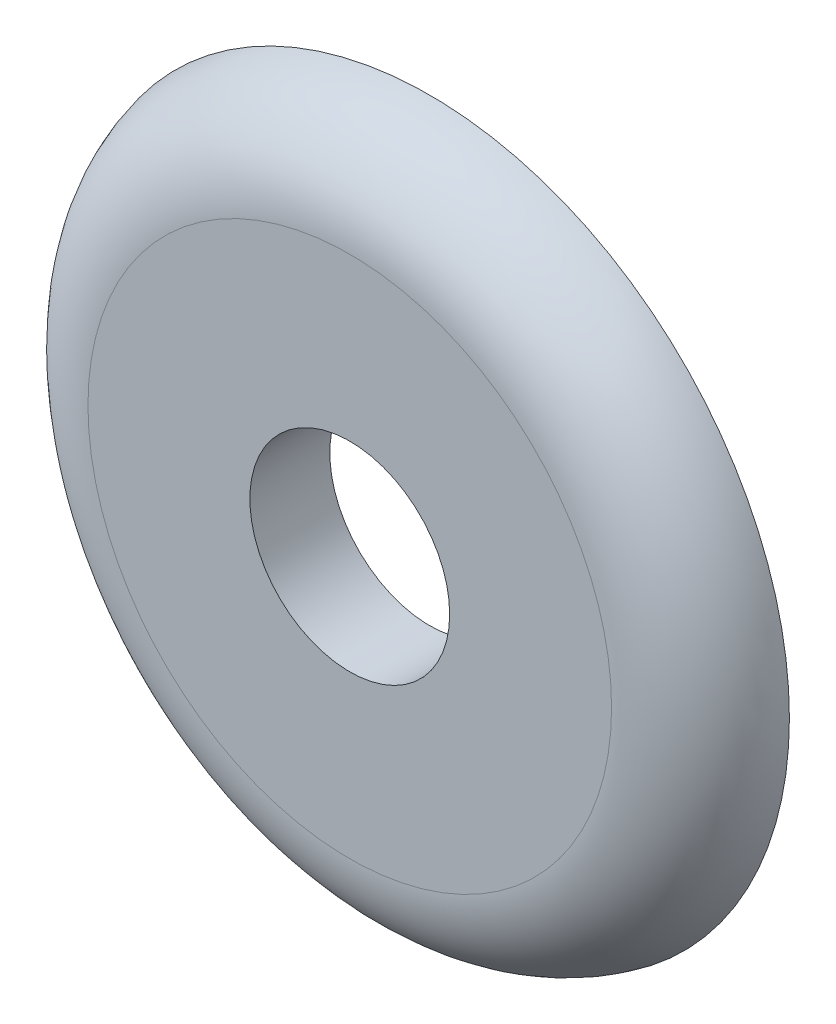
ISO-10303-21;
HEADER;
FILE_DESCRIPTION(('STEP AP214'),'2;1');
FILE_NAME('part.step','',(''),(''),'','','');
FILE_SCHEMA(('AUTOMOTIVE_DESIGN { 1 0 10303 214 1 1 1 1 }'));
ENDSEC;
DATA;
#1=APPLICATION_CONTEXT('core data for automotive mechanical design processes');
#2=APPLICATION_PROTOCOL_DEFINITION('international standard','automotive_design',2000,#1);
#3=PRODUCT_CONTEXT('',#1,'mechanical');
#4=PRODUCT('Part','Part','',(#3));
#5=PRODUCT_RELATED_PRODUCT_CATEGORY('part','',(#4));
#6=PRODUCT_DEFINITION_FORMATION('','',#4);
#7=PRODUCT_DEFINITION_CONTEXT('part definition',#1,'design');
#8=PRODUCT_DEFINITION('design','',#6,#7);
#9=PRODUCT_DEFINITION_SHAPE('','',#8);
#10=(LENGTH_UNIT() NAMED_UNIT(*) SI_UNIT(.MILLI.,.METRE.));
#11=(NAMED_UNIT(*) PLANE_ANGLE_UNIT() SI_UNIT($,.RADIAN.));
#12=(NAMED_UNIT(*) SI_UNIT($,.STERADIAN.) SOLID_ANGLE_UNIT());
#13=UNCERTAINTY_MEASURE_WITH_UNIT(LENGTH_MEASURE(1.E-05),#10,'distance_accuracy_value','');
#14=(GEOMETRIC_REPRESENTATION_CONTEXT(3) GLOBAL_UNCERTAINTY_ASSIGNED_CONTEXT((#13)) GLOBAL_UNIT_ASSIGNED_CONTEXT((#10,
#11,#12)) REPRESENTATION_CONTEXT('',''));
#15=CARTESIAN_POINT('',(0.,0.,0.));
#16=DIRECTION('',(0.,0.,1.));
#17=DIRECTION('',(1.,0.,0.));
#18=AXIS2_PLACEMENT_3D('',#15,#16,#17);
#19=CARTESIAN_POINT('',(0.,0.,-0.25));
#20=DIRECTION('',(0.,0.,1.));
#21=DIRECTION('',(1.,0.,0.));
#22=AXIS2_PLACEMENT_3D('',#19,#20,#21);
#23=TOROIDAL_SURFACE('',#22,3.27525512860841,1.25);
#24=CARTESIAN_POINT('',(0.,0.,0.));
#25=DIRECTION('',(0.,0.,-1.));
#26=DIRECTION('',(1.,0.,0.));
#27=AXIS2_PLACEMENT_3D('',#24,#25,#26);
#28=CIRCLE('',#27,4.5);
#29=CARTESIAN_POINT('',(4.5,0.,0.));
#30=VERTEX_POINT('',#29);
#31=EDGE_CURVE('E11',#30,#30,#28,.T.);
#32=ORIENTED_EDGE('',*,*,#31,.F.);
#33=EDGE_LOOP('',(#32));
#34=FACE_BOUND('',#33,.T.);
#35=CARTESIAN_POINT('',(0.,0.,1.));
#36=DIRECTION('',(0.,0.,1.));
#37=DIRECTION('',(-1.,0.,0.));
#38=AXIS2_PLACEMENT_3D('',#35,#36,#37);
#39=CIRCLE('',#38,3.27525512860841);
#40=CARTESIAN_POINT('',(-3.27525512860841,0.,1.));
#41=VERTEX_POINT('',#40);
#42=EDGE_CURVE('E19',#41,#41,#39,.T.);
#43=ORIENTED_EDGE('',*,*,#42,.F.);
#44=EDGE_LOOP('',(#43));
#45=FACE_BOUND('',#44,.T.);
#46=ADVANCED_FACE('F16',(#34,#45),#23,.T.);
#47=CARTESIAN_POINT('',(0.,0.,0.));
#48=DIRECTION('',(0.,0.,-1.));
#49=DIRECTION('',(0.,-1.,0.));
#50=AXIS2_PLACEMENT_3D('',#47,#48,#49);
#51=PLANE('',#50);
#52=ORIENTED_EDGE('',*,*,#31,.T.);
#53=EDGE_LOOP('',(#52));
#54=FACE_BOUND('',#53,.T.);
#55=CARTESIAN_POINT('',(0.,0.,0.));
#56=DIRECTION('',(0.,0.,-1.));
#57=DIRECTION('',(1.,0.,0.));
#58=AXIS2_PLACEMENT_3D('',#55,#56,#57);
#59=CIRCLE('',#58,1.25);
#60=CARTESIAN_POINT('',(1.25,0.,0.));
#61=VERTEX_POINT('',#60);
#62=EDGE_CURVE('E50',#61,#61,#59,.T.);
#63=ORIENTED_EDGE('',*,*,#62,.F.);
#64=EDGE_LOOP('',(#63));
#65=FACE_BOUND('',#64,.T.);
#66=ADVANCED_FACE('F76',(#54,#65),#51,.T.);
#67=CARTESIAN_POINT('',(0.,0.,1.));
#68=DIRECTION('',(0.,0.,-1.));
#69=DIRECTION('',(0.,-1.,0.));
#70=AXIS2_PLACEMENT_3D('',#67,#68,#69);
#71=PLANE('',#70);
#72=CARTESIAN_POINT('',(0.,0.,1.));
#73=DIRECTION('',(0.,0.,-1.));
#74=DIRECTION('',(1.,0.,0.));
#75=AXIS2_PLACEMENT_3D('',#72,#73,#74);
#76=CIRCLE('',#75,1.25);
#77=CARTESIAN_POINT('',(1.25,0.,1.));
#78=VERTEX_POINT('',#77);
#79=EDGE_CURVE('E44',#78,#78,#76,.T.);
#80=ORIENTED_EDGE('',*,*,#79,.T.);
#81=EDGE_LOOP('',(#80));
#82=FACE_BOUND('',#81,.T.);
#83=ORIENTED_EDGE('',*,*,#42,.T.);
#84=EDGE_LOOP('',(#83));
#85=FACE_BOUND('',#84,.T.);
#86=ADVANCED_FACE('F81',(#82,#85),#71,.F.);
#87=CARTESIAN_POINT('',(0.,0.,1.));
#88=DIRECTION('',(0.,0.,-1.));
#89=DIRECTION('',(-1.,0.,0.));
#90=AXIS2_PLACEMENT_3D('',#87,#88,#89);
#91=CYLINDRICAL_SURFACE('',#90,1.25);
#92=ORIENTED_EDGE('',*,*,#62,.T.);
#93=EDGE_LOOP('',(#92));
#94=FACE_BOUND('',#93,.T.);
#95=ORIENTED_EDGE('',*,*,#79,.F.);
#96=EDGE_LOOP('',(#95));
#97=FACE_BOUND('',#96,.T.);
#98=ADVANCED_FACE('F51',(#94,#97),#91,.F.);
#99=CLOSED_SHELL('',(#46,#66,#86,#98));
#100=MANIFOLD_SOLID_BREP('B1',#99);
#101=ADVANCED_BREP_SHAPE_REPRESENTATION('',(#18,#100),#14);
#102=SHAPE_DEFINITION_REPRESENTATION(#9,#101);
ENDSEC;
END-ISO-10303-21;
